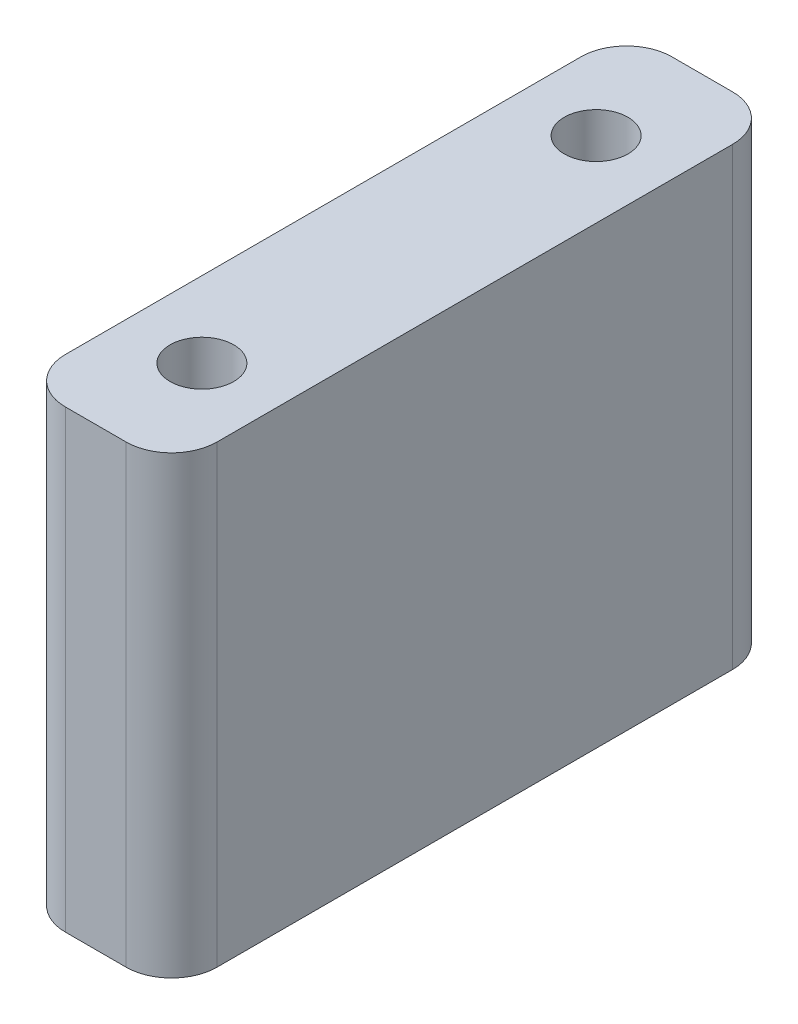
ISO-10303-21;
HEADER;
FILE_DESCRIPTION(('STEP AP214'),'2;1');
FILE_NAME('part.step','',(''),(''),'','','');
FILE_SCHEMA(('AUTOMOTIVE_DESIGN { 1 0 10303 214 1 1 1 1 }'));
ENDSEC;
DATA;
#1=APPLICATION_CONTEXT('core data for automotive mechanical design processes');
#2=APPLICATION_PROTOCOL_DEFINITION('international standard','automotive_design',2000,#1);
#3=PRODUCT_CONTEXT('',#1,'mechanical');
#4=PRODUCT('Part','Part','',(#3));
#5=PRODUCT_RELATED_PRODUCT_CATEGORY('part','',(#4));
#6=PRODUCT_DEFINITION_FORMATION('','',#4);
#7=PRODUCT_DEFINITION_CONTEXT('part definition',#1,'design');
#8=PRODUCT_DEFINITION('design','',#6,#7);
#9=PRODUCT_DEFINITION_SHAPE('','',#8);
#10=(LENGTH_UNIT() NAMED_UNIT(*) SI_UNIT(.MILLI.,.METRE.));
#11=(NAMED_UNIT(*) PLANE_ANGLE_UNIT() SI_UNIT($,.RADIAN.));
#12=(NAMED_UNIT(*) SI_UNIT($,.STERADIAN.) SOLID_ANGLE_UNIT());
#13=UNCERTAINTY_MEASURE_WITH_UNIT(LENGTH_MEASURE(1.E-05),#10,'distance_accuracy_value','');
#14=(GEOMETRIC_REPRESENTATION_CONTEXT(3) GLOBAL_UNCERTAINTY_ASSIGNED_CONTEXT((#13)) GLOBAL_UNIT_ASSIGNED_CONTEXT((#10,
#11,#12)) REPRESENTATION_CONTEXT('',''));
#15=CARTESIAN_POINT('',(0.,0.,0.));
#16=DIRECTION('',(0.,0.,1.));
#17=DIRECTION('',(1.,0.,0.));
#18=AXIS2_PLACEMENT_3D('',#15,#16,#17);
#19=CARTESIAN_POINT('',(0.,30.,0.));
#20=DIRECTION('',(0.,1.,0.));
#21=DIRECTION('',(0.,0.,1.));
#22=AXIS2_PLACEMENT_3D('',#19,#20,#21);
#23=PLANE('',#22);
#24=CARTESIAN_POINT('',(-5.,30.,7.));
#25=DIRECTION('',(0.,1.,0.));
#26=DIRECTION('',(0.,0.,1.));
#27=AXIS2_PLACEMENT_3D('',#24,#25,#26);
#28=CIRCLE('',#27,2.1);
#29=CARTESIAN_POINT('',(-5.,30.,9.1));
#30=VERTEX_POINT('',#29);
#31=EDGE_CURVE('E135',#30,#30,#28,.T.);
#32=ORIENTED_EDGE('',*,*,#31,.F.);
#33=EDGE_LOOP('',(#32));
#34=FACE_BOUND('',#33,.T.);
#35=DIRECTION('',(0.,0.,1.));
#36=VECTOR('',#35,1.);
#37=CARTESIAN_POINT('',(-10.,30.,0.));
#38=LINE('',#37,#36);
#39=CARTESIAN_POINT('',(-10.,30.,3.));
#40=VERTEX_POINT('',#39);
#41=CARTESIAN_POINT('',(-9.99999999999999,30.,37.));
#42=VERTEX_POINT('',#41);
#43=EDGE_CURVE('E140',#40,#42,#38,.T.);
#44=ORIENTED_EDGE('',*,*,#43,.T.);
#45=CARTESIAN_POINT('',(-7.,30.,37.));
#46=DIRECTION('',(0.,1.,0.));
#47=DIRECTION('',(0.,0.,1.));
#48=AXIS2_PLACEMENT_3D('',#45,#46,#47);
#49=CIRCLE('',#48,3.);
#50=CARTESIAN_POINT('',(-7.,30.,40.));
#51=VERTEX_POINT('',#50);
#52=EDGE_CURVE('E155',#42,#51,#49,.T.);
#53=ORIENTED_EDGE('',*,*,#52,.T.);
#54=DIRECTION('',(1.,0.,0.));
#55=VECTOR('',#54,1.);
#56=CARTESIAN_POINT('',(-9.99999999999999,30.,40.));
#57=LINE('',#56,#55);
#58=CARTESIAN_POINT('',(-3.,30.,40.));
#59=VERTEX_POINT('',#58);
#60=EDGE_CURVE('E122',#51,#59,#57,.T.);
#61=ORIENTED_EDGE('',*,*,#60,.T.);
#62=CARTESIAN_POINT('',(-3.,30.,37.));
#63=DIRECTION('',(0.,1.,0.));
#64=DIRECTION('',(0.,0.,1.));
#65=AXIS2_PLACEMENT_3D('',#62,#63,#64);
#66=CIRCLE('',#65,3.);
#67=CARTESIAN_POINT('',(0.,30.,37.));
#68=VERTEX_POINT('',#67);
#69=EDGE_CURVE('E153',#59,#68,#66,.T.);
#70=ORIENTED_EDGE('',*,*,#69,.T.);
#71=DIRECTION('',(0.,0.,-1.));
#72=VECTOR('',#71,1.);
#73=CARTESIAN_POINT('',(0.,30.,0.));
#74=LINE('',#73,#72);
#75=CARTESIAN_POINT('',(0.,30.,3.));
#76=VERTEX_POINT('',#75);
#77=EDGE_CURVE('E166',#68,#76,#74,.T.);
#78=ORIENTED_EDGE('',*,*,#77,.T.);
#79=CARTESIAN_POINT('',(-3.,30.,3.));
#80=DIRECTION('',(0.,1.,0.));
#81=DIRECTION('',(0.,0.,1.));
#82=AXIS2_PLACEMENT_3D('',#79,#80,#81);
#83=CIRCLE('',#82,3.);
#84=CARTESIAN_POINT('',(-3.,30.,0.));
#85=VERTEX_POINT('',#84);
#86=EDGE_CURVE('E57',#76,#85,#83,.T.);
#87=ORIENTED_EDGE('',*,*,#86,.T.);
#88=DIRECTION('',(-1.,0.,0.));
#89=VECTOR('',#88,1.);
#90=CARTESIAN_POINT('',(-10.,30.,0.));
#91=LINE('',#90,#89);
#92=CARTESIAN_POINT('',(-7.,30.,0.));
#93=VERTEX_POINT('',#92);
#94=EDGE_CURVE('E141',#85,#93,#91,.T.);
#95=ORIENTED_EDGE('',*,*,#94,.T.);
#96=CARTESIAN_POINT('',(-7.,30.,3.));
#97=DIRECTION('',(0.,1.,0.));
#98=DIRECTION('',(0.,0.,1.));
#99=AXIS2_PLACEMENT_3D('',#96,#97,#98);
#100=CIRCLE('',#99,3.);
#101=EDGE_CURVE('E150',#93,#40,#100,.T.);
#102=ORIENTED_EDGE('',*,*,#101,.T.);
#103=EDGE_LOOP('',(#44,#53,#61,#70,#78,#87,#95,#102));
#104=FACE_BOUND('',#103,.T.);
#105=CARTESIAN_POINT('',(-5.,30.,33.));
#106=DIRECTION('',(0.,1.,0.));
#107=DIRECTION('',(0.,0.,1.));
#108=AXIS2_PLACEMENT_3D('',#105,#106,#107);
#109=CIRCLE('',#108,2.1);
#110=CARTESIAN_POINT('',(-5.,30.,35.1));
#111=VERTEX_POINT('',#110);
#112=EDGE_CURVE('E183',#111,#111,#109,.T.);
#113=ORIENTED_EDGE('',*,*,#112,.F.);
#114=EDGE_LOOP('',(#113));
#115=FACE_BOUND('',#114,.T.);
#116=ADVANCED_FACE('F36',(#34,#104,#115),#23,.T.);
#117=CARTESIAN_POINT('',(0.,0.,0.));
#118=DIRECTION('',(0.,1.,0.));
#119=DIRECTION('',(0.,0.,1.));
#120=AXIS2_PLACEMENT_3D('',#117,#118,#119);
#121=PLANE('',#120);
#122=DIRECTION('',(1.,0.,0.));
#123=VECTOR('',#122,1.);
#124=CARTESIAN_POINT('',(-9.99999999999999,0.,40.));
#125=LINE('',#124,#123);
#126=CARTESIAN_POINT('',(-7.,0.,40.));
#127=VERTEX_POINT('',#126);
#128=CARTESIAN_POINT('',(-3.,0.,40.));
#129=VERTEX_POINT('',#128);
#130=EDGE_CURVE('E119',#127,#129,#125,.T.);
#131=ORIENTED_EDGE('',*,*,#130,.F.);
#132=CARTESIAN_POINT('',(-7.,0.,37.));
#133=DIRECTION('',(0.,1.,0.));
#134=DIRECTION('',(0.,0.,1.));
#135=AXIS2_PLACEMENT_3D('',#132,#133,#134);
#136=CIRCLE('',#135,3.);
#137=CARTESIAN_POINT('',(-9.99999999999999,0.,37.));
#138=VERTEX_POINT('',#137);
#139=EDGE_CURVE('E102',#127,#138,#136,.F.);
#140=ORIENTED_EDGE('',*,*,#139,.T.);
#141=DIRECTION('',(0.,0.,1.));
#142=VECTOR('',#141,1.);
#143=CARTESIAN_POINT('',(-10.,0.,0.));
#144=LINE('',#143,#142);
#145=CARTESIAN_POINT('',(-10.,0.,3.));
#146=VERTEX_POINT('',#145);
#147=EDGE_CURVE('E130',#146,#138,#144,.T.);
#148=ORIENTED_EDGE('',*,*,#147,.F.);
#149=CARTESIAN_POINT('',(-7.,0.,3.));
#150=DIRECTION('',(0.,1.,0.));
#151=DIRECTION('',(0.,0.,1.));
#152=AXIS2_PLACEMENT_3D('',#149,#150,#151);
#153=CIRCLE('',#152,3.);
#154=CARTESIAN_POINT('',(-7.,0.,0.));
#155=VERTEX_POINT('',#154);
#156=EDGE_CURVE('E123',#146,#155,#153,.F.);
#157=ORIENTED_EDGE('',*,*,#156,.T.);
#158=DIRECTION('',(-1.,0.,0.));
#159=VECTOR('',#158,1.);
#160=CARTESIAN_POINT('',(-10.,0.,0.));
#161=LINE('',#160,#159);
#162=CARTESIAN_POINT('',(-3.,0.,0.));
#163=VERTEX_POINT('',#162);
#164=EDGE_CURVE('E133',#163,#155,#161,.T.);
#165=ORIENTED_EDGE('',*,*,#164,.F.);
#166=CARTESIAN_POINT('',(-3.,0.,3.));
#167=DIRECTION('',(0.,1.,0.));
#168=DIRECTION('',(0.,0.,1.));
#169=AXIS2_PLACEMENT_3D('',#166,#167,#168);
#170=CIRCLE('',#169,3.);
#171=CARTESIAN_POINT('',(0.,0.,3.));
#172=VERTEX_POINT('',#171);
#173=EDGE_CURVE('E144',#163,#172,#170,.F.);
#174=ORIENTED_EDGE('',*,*,#173,.T.);
#175=DIRECTION('',(0.,0.,-1.));
#176=VECTOR('',#175,1.);
#177=CARTESIAN_POINT('',(0.,0.,0.));
#178=LINE('',#177,#176);
#179=CARTESIAN_POINT('',(0.,0.,37.));
#180=VERTEX_POINT('',#179);
#181=EDGE_CURVE('E129',#180,#172,#178,.T.);
#182=ORIENTED_EDGE('',*,*,#181,.F.);
#183=CARTESIAN_POINT('',(-3.,0.,37.));
#184=DIRECTION('',(0.,1.,0.));
#185=DIRECTION('',(0.,0.,1.));
#186=AXIS2_PLACEMENT_3D('',#183,#184,#185);
#187=CIRCLE('',#186,3.);
#188=EDGE_CURVE('E113',#180,#129,#187,.F.);
#189=ORIENTED_EDGE('',*,*,#188,.T.);
#190=EDGE_LOOP('',(#131,#140,#148,#157,#165,#174,#182,#189));
#191=FACE_BOUND('',#190,.T.);
#192=CARTESIAN_POINT('',(-5.,0.,7.));
#193=DIRECTION('',(0.,1.,0.));
#194=DIRECTION('',(0.,0.,1.));
#195=AXIS2_PLACEMENT_3D('',#192,#193,#194);
#196=CIRCLE('',#195,2.1);
#197=CARTESIAN_POINT('',(-5.,0.,9.1));
#198=VERTEX_POINT('',#197);
#199=EDGE_CURVE('E180',#198,#198,#196,.T.);
#200=ORIENTED_EDGE('',*,*,#199,.T.);
#201=EDGE_LOOP('',(#200));
#202=FACE_BOUND('',#201,.T.);
#203=CARTESIAN_POINT('',(-5.,0.,33.));
#204=DIRECTION('',(0.,1.,0.));
#205=DIRECTION('',(0.,0.,1.));
#206=AXIS2_PLACEMENT_3D('',#203,#204,#205);
#207=CIRCLE('',#206,2.1);
#208=CARTESIAN_POINT('',(-5.,0.,35.1));
#209=VERTEX_POINT('',#208);
#210=EDGE_CURVE('E186',#209,#209,#207,.T.);
#211=ORIENTED_EDGE('',*,*,#210,.T.);
#212=EDGE_LOOP('',(#211));
#213=FACE_BOUND('',#212,.T.);
#214=ADVANCED_FACE('F126',(#191,#202,#213),#121,.F.);
#215=CARTESIAN_POINT('',(-10.,30.,0.));
#216=DIRECTION('',(1.,0.,0.));
#217=DIRECTION('',(0.,0.,-1.));
#218=AXIS2_PLACEMENT_3D('',#215,#216,#217);
#219=PLANE('',#218);
#220=ORIENTED_EDGE('',*,*,#147,.T.);
#221=DIRECTION('',(0.,-1.,0.));
#222=VECTOR('',#221,1.);
#223=CARTESIAN_POINT('',(-9.99999999999999,30.,37.));
#224=LINE('',#223,#222);
#225=EDGE_CURVE('E107',#138,#42,#224,.F.);
#226=ORIENTED_EDGE('',*,*,#225,.T.);
#227=ORIENTED_EDGE('',*,*,#43,.F.);
#228=DIRECTION('',(0.,-1.,0.));
#229=VECTOR('',#228,1.);
#230=CARTESIAN_POINT('',(-10.,30.,3.));
#231=LINE('',#230,#229);
#232=EDGE_CURVE('E112',#40,#146,#231,.T.);
#233=ORIENTED_EDGE('',*,*,#232,.T.);
#234=EDGE_LOOP('',(#220,#226,#227,#233));
#235=FACE_BOUND('',#234,.T.);
#236=ADVANCED_FACE('F201',(#235),#219,.F.);
#237=CARTESIAN_POINT('',(-9.99999999999999,30.,40.));
#238=DIRECTION('',(0.,0.,-1.));
#239=DIRECTION('',(-1.,0.,0.));
#240=AXIS2_PLACEMENT_3D('',#237,#238,#239);
#241=PLANE('',#240);
#242=ORIENTED_EDGE('',*,*,#60,.F.);
#243=DIRECTION('',(0.,-1.,0.));
#244=VECTOR('',#243,1.);
#245=CARTESIAN_POINT('',(-7.,30.,40.));
#246=LINE('',#245,#244);
#247=EDGE_CURVE('E106',#51,#127,#246,.T.);
#248=ORIENTED_EDGE('',*,*,#247,.T.);
#249=ORIENTED_EDGE('',*,*,#130,.T.);
#250=DIRECTION('',(0.,-1.,0.));
#251=VECTOR('',#250,1.);
#252=CARTESIAN_POINT('',(-3.,30.,40.));
#253=LINE('',#252,#251);
#254=EDGE_CURVE('E124',#129,#59,#253,.F.);
#255=ORIENTED_EDGE('',*,*,#254,.T.);
#256=EDGE_LOOP('',(#242,#248,#249,#255));
#257=FACE_BOUND('',#256,.T.);
#258=ADVANCED_FACE('F118',(#257),#241,.F.);
#259=CARTESIAN_POINT('',(0.,30.,0.));
#260=DIRECTION('',(-1.,0.,0.));
#261=DIRECTION('',(0.,0.,1.));
#262=AXIS2_PLACEMENT_3D('',#259,#260,#261);
#263=PLANE('',#262);
#264=ORIENTED_EDGE('',*,*,#77,.F.);
#265=DIRECTION('',(0.,-1.,0.));
#266=VECTOR('',#265,1.);
#267=CARTESIAN_POINT('',(0.,30.,37.));
#268=LINE('',#267,#266);
#269=EDGE_CURVE('E159',#68,#180,#268,.T.);
#270=ORIENTED_EDGE('',*,*,#269,.T.);
#271=ORIENTED_EDGE('',*,*,#181,.T.);
#272=DIRECTION('',(0.,-1.,0.));
#273=VECTOR('',#272,1.);
#274=CARTESIAN_POINT('',(0.,30.,3.));
#275=LINE('',#274,#273);
#276=EDGE_CURVE('E157',#172,#76,#275,.F.);
#277=ORIENTED_EDGE('',*,*,#276,.T.);
#278=EDGE_LOOP('',(#264,#270,#271,#277));
#279=FACE_BOUND('',#278,.T.);
#280=ADVANCED_FACE('F164',(#279),#263,.F.);
#281=CARTESIAN_POINT('',(-10.,30.,0.));
#282=DIRECTION('',(0.,0.,1.));
#283=DIRECTION('',(1.,0.,0.));
#284=AXIS2_PLACEMENT_3D('',#281,#282,#283);
#285=PLANE('',#284);
#286=ORIENTED_EDGE('',*,*,#94,.F.);
#287=DIRECTION('',(0.,-1.,0.));
#288=VECTOR('',#287,1.);
#289=CARTESIAN_POINT('',(-3.,30.,0.));
#290=LINE('',#289,#288);
#291=EDGE_CURVE('E11',#85,#163,#290,.T.);
#292=ORIENTED_EDGE('',*,*,#291,.T.);
#293=ORIENTED_EDGE('',*,*,#164,.T.);
#294=DIRECTION('',(0.,-1.,0.));
#295=VECTOR('',#294,1.);
#296=CARTESIAN_POINT('',(-7.,30.,0.));
#297=LINE('',#296,#295);
#298=EDGE_CURVE('E44',#155,#93,#297,.F.);
#299=ORIENTED_EDGE('',*,*,#298,.T.);
#300=EDGE_LOOP('',(#286,#292,#293,#299));
#301=FACE_BOUND('',#300,.T.);
#302=ADVANCED_FACE('F173',(#301),#285,.F.);
#303=CARTESIAN_POINT('',(-5.,30.,7.));
#304=DIRECTION('',(0.,-1.,0.));
#305=DIRECTION('',(0.,0.,-1.));
#306=AXIS2_PLACEMENT_3D('',#303,#304,#305);
#307=CYLINDRICAL_SURFACE('',#306,2.1);
#308=ORIENTED_EDGE('',*,*,#31,.T.);
#309=EDGE_LOOP('',(#308));
#310=FACE_BOUND('',#309,.T.);
#311=ORIENTED_EDGE('',*,*,#199,.F.);
#312=EDGE_LOOP('',(#311));
#313=FACE_BOUND('',#312,.T.);
#314=ADVANCED_FACE('F205',(#310,#313),#307,.F.);
#315=CARTESIAN_POINT('',(-5.,30.,33.));
#316=DIRECTION('',(0.,-1.,0.));
#317=DIRECTION('',(0.,0.,-1.));
#318=AXIS2_PLACEMENT_3D('',#315,#316,#317);
#319=CYLINDRICAL_SURFACE('',#318,2.1);
#320=ORIENTED_EDGE('',*,*,#112,.T.);
#321=EDGE_LOOP('',(#320));
#322=FACE_BOUND('',#321,.T.);
#323=ORIENTED_EDGE('',*,*,#210,.F.);
#324=EDGE_LOOP('',(#323));
#325=FACE_BOUND('',#324,.T.);
#326=ADVANCED_FACE('F192',(#322,#325),#319,.F.);
#327=CARTESIAN_POINT('',(-7.,30.,37.));
#328=DIRECTION('',(0.,-1.,0.));
#329=DIRECTION('',(0.,0.,-1.));
#330=AXIS2_PLACEMENT_3D('',#327,#328,#329);
#331=CYLINDRICAL_SURFACE('',#330,3.);
#332=ORIENTED_EDGE('',*,*,#52,.F.);
#333=ORIENTED_EDGE('',*,*,#225,.F.);
#334=ORIENTED_EDGE('',*,*,#139,.F.);
#335=ORIENTED_EDGE('',*,*,#247,.F.);
#336=EDGE_LOOP('',(#332,#333,#334,#335));
#337=FACE_BOUND('',#336,.T.);
#338=ADVANCED_FACE('F105',(#337),#331,.T.);
#339=CARTESIAN_POINT('',(-3.,30.,37.));
#340=DIRECTION('',(0.,-1.,0.));
#341=DIRECTION('',(0.,0.,-1.));
#342=AXIS2_PLACEMENT_3D('',#339,#340,#341);
#343=CYLINDRICAL_SURFACE('',#342,3.);
#344=ORIENTED_EDGE('',*,*,#69,.F.);
#345=ORIENTED_EDGE('',*,*,#254,.F.);
#346=ORIENTED_EDGE('',*,*,#188,.F.);
#347=ORIENTED_EDGE('',*,*,#269,.F.);
#348=EDGE_LOOP('',(#344,#345,#346,#347));
#349=FACE_BOUND('',#348,.T.);
#350=ADVANCED_FACE('F219',(#349),#343,.T.);
#351=CARTESIAN_POINT('',(-3.,30.,3.));
#352=DIRECTION('',(0.,-1.,0.));
#353=DIRECTION('',(0.,0.,-1.));
#354=AXIS2_PLACEMENT_3D('',#351,#352,#353);
#355=CYLINDRICAL_SURFACE('',#354,3.);
#356=ORIENTED_EDGE('',*,*,#86,.F.);
#357=ORIENTED_EDGE('',*,*,#276,.F.);
#358=ORIENTED_EDGE('',*,*,#173,.F.);
#359=ORIENTED_EDGE('',*,*,#291,.F.);
#360=EDGE_LOOP('',(#356,#357,#358,#359));
#361=FACE_BOUND('',#360,.T.);
#362=ADVANCED_FACE('F172',(#361),#355,.T.);
#363=CARTESIAN_POINT('',(-7.,30.,3.));
#364=DIRECTION('',(0.,-1.,0.));
#365=DIRECTION('',(0.,0.,-1.));
#366=AXIS2_PLACEMENT_3D('',#363,#364,#365);
#367=CYLINDRICAL_SURFACE('',#366,3.);
#368=ORIENTED_EDGE('',*,*,#101,.F.);
#369=ORIENTED_EDGE('',*,*,#298,.F.);
#370=ORIENTED_EDGE('',*,*,#156,.F.);
#371=ORIENTED_EDGE('',*,*,#232,.F.);
#372=EDGE_LOOP('',(#368,#369,#370,#371));
#373=FACE_BOUND('',#372,.T.);
#374=ADVANCED_FACE('F38',(#373),#367,.T.);
#375=CLOSED_SHELL('',(#116,#214,#236,#258,#280,#302,#314,#326,#338,#350,#362,#374));
#376=MANIFOLD_SOLID_BREP('B2',#375);
#377=ADVANCED_BREP_SHAPE_REPRESENTATION('',(#18,#376),#14);
#378=SHAPE_DEFINITION_REPRESENTATION(#9,#377);
ENDSEC;
END-ISO-10303-21;
